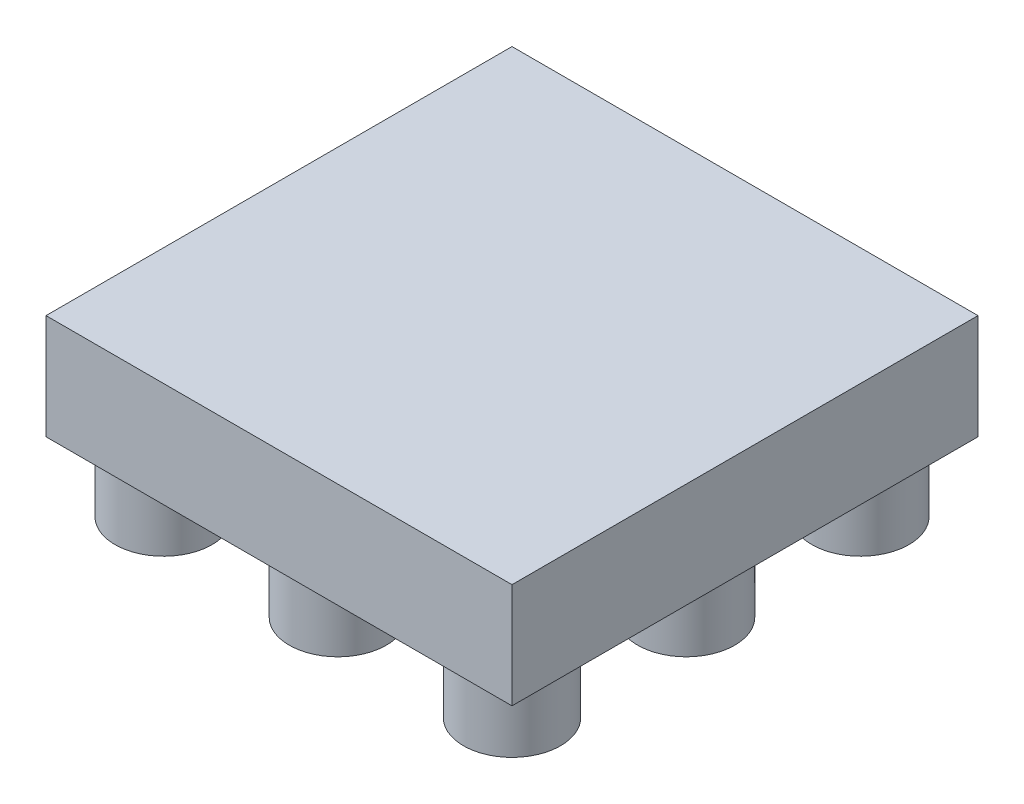
ISO-10303-21;
HEADER;
FILE_DESCRIPTION(('STEP AP214'),'2;1');
FILE_NAME('part.step','',(''),(''),'','','');
FILE_SCHEMA(('AUTOMOTIVE_DESIGN { 1 0 10303 214 1 1 1 1 }'));
ENDSEC;
DATA;
#1=APPLICATION_CONTEXT('core data for automotive mechanical design processes');
#2=APPLICATION_PROTOCOL_DEFINITION('international standard','automotive_design',2000,#1);
#3=PRODUCT_CONTEXT('',#1,'mechanical');
#4=PRODUCT('Part','Part','',(#3));
#5=PRODUCT_RELATED_PRODUCT_CATEGORY('part','',(#4));
#6=PRODUCT_DEFINITION_FORMATION('','',#4);
#7=PRODUCT_DEFINITION_CONTEXT('part definition',#1,'design');
#8=PRODUCT_DEFINITION('design','',#6,#7);
#9=PRODUCT_DEFINITION_SHAPE('','',#8);
#10=(LENGTH_UNIT() NAMED_UNIT(*) SI_UNIT(.MILLI.,.METRE.));
#11=(NAMED_UNIT(*) PLANE_ANGLE_UNIT() SI_UNIT($,.RADIAN.));
#12=(NAMED_UNIT(*) SI_UNIT($,.STERADIAN.) SOLID_ANGLE_UNIT());
#13=UNCERTAINTY_MEASURE_WITH_UNIT(LENGTH_MEASURE(1.E-05),#10,'distance_accuracy_value','');
#14=(GEOMETRIC_REPRESENTATION_CONTEXT(3) GLOBAL_UNCERTAINTY_ASSIGNED_CONTEXT((#13)) GLOBAL_UNIT_ASSIGNED_CONTEXT((#10,
#11,#12)) REPRESENTATION_CONTEXT('',''));
#15=CARTESIAN_POINT('',(0.,0.,0.));
#16=DIRECTION('',(0.,0.,1.));
#17=DIRECTION('',(1.,0.,0.));
#18=AXIS2_PLACEMENT_3D('',#15,#16,#17);
#19=CARTESIAN_POINT('',(7.01,1.5875,-26.31));
#20=DIRECTION('',(0.,-1.,0.));
#21=DIRECTION('',(0.,0.,-1.));
#22=AXIS2_PLACEMENT_3D('',#19,#20,#21);
#23=PLANE('',#22);
#24=CARTESIAN_POINT('',(12.3599999999999,1.5875,-16.96));
#25=DIRECTION('',(0.,-1.,0.));
#26=DIRECTION('',(0.,0.,-1.));
#27=AXIS2_PLACEMENT_3D('',#24,#25,#26);
#28=CIRCLE('',#27,1.115);
#29=CARTESIAN_POINT('',(12.3599999999999,1.5875,-18.075));
#30=VERTEX_POINT('',#29);
#31=EDGE_CURVE('E187',#30,#30,#28,.T.);
#32=ORIENTED_EDGE('',*,*,#31,.F.);
#33=EDGE_LOOP('',(#32));
#34=FACE_BOUND('',#33,.T.);
#35=CARTESIAN_POINT('',(8.35999999999996,1.5875,-20.9600000000001));
#36=DIRECTION('',(0.,-1.,0.));
#37=DIRECTION('',(0.,0.,-1.));
#38=AXIS2_PLACEMENT_3D('',#35,#36,#37);
#39=CIRCLE('',#38,1.115);
#40=CARTESIAN_POINT('',(8.35999999999996,1.5875,-22.0750000000001));
#41=VERTEX_POINT('',#40);
#42=EDGE_CURVE('E173',#41,#41,#39,.T.);
#43=ORIENTED_EDGE('',*,*,#42,.F.);
#44=EDGE_LOOP('',(#43));
#45=FACE_BOUND('',#44,.T.);
#46=CARTESIAN_POINT('',(16.36,1.5875,-20.96));
#47=DIRECTION('',(0.,-1.,0.));
#48=DIRECTION('',(0.,0.,-1.));
#49=AXIS2_PLACEMENT_3D('',#46,#47,#48);
#50=CIRCLE('',#49,1.115);
#51=CARTESIAN_POINT('',(16.36,1.5875,-22.075));
#52=VERTEX_POINT('',#51);
#53=EDGE_CURVE('E158',#52,#52,#50,.T.);
#54=ORIENTED_EDGE('',*,*,#53,.F.);
#55=EDGE_LOOP('',(#54));
#56=FACE_BOUND('',#55,.T.);
#57=CARTESIAN_POINT('',(12.36,1.5875,-24.96));
#58=DIRECTION('',(0.,-1.,0.));
#59=DIRECTION('',(0.,0.,-1.));
#60=AXIS2_PLACEMENT_3D('',#57,#58,#59);
#61=CIRCLE('',#60,1.115);
#62=CARTESIAN_POINT('',(12.36,1.5875,-26.075));
#63=VERTEX_POINT('',#62);
#64=EDGE_CURVE('E142',#63,#63,#61,.T.);
#65=ORIENTED_EDGE('',*,*,#64,.F.);
#66=EDGE_LOOP('',(#65));
#67=FACE_BOUND('',#66,.T.);
#68=DIRECTION('',(0.,0.,1.));
#69=VECTOR('',#68,1.);
#70=CARTESIAN_POINT('',(7.01,1.5875,-15.61));
#71=LINE('',#70,#69);
#72=CARTESIAN_POINT('',(7.01,1.5875,-26.31));
#73=VERTEX_POINT('',#72);
#74=CARTESIAN_POINT('',(7.01,1.5875,-15.61));
#75=VERTEX_POINT('',#74);
#76=EDGE_CURVE('E111',#73,#75,#71,.T.);
#77=ORIENTED_EDGE('',*,*,#76,.F.);
#78=DIRECTION('',(-1.,0.,0.));
#79=VECTOR('',#78,1.);
#80=CARTESIAN_POINT('',(7.01,1.5875,-26.31));
#81=LINE('',#80,#79);
#82=CARTESIAN_POINT('',(17.71,1.5875,-26.31));
#83=VERTEX_POINT('',#82);
#84=EDGE_CURVE('E81',#83,#73,#81,.T.);
#85=ORIENTED_EDGE('',*,*,#84,.F.);
#86=DIRECTION('',(0.,0.,-1.));
#87=VECTOR('',#86,1.);
#88=CARTESIAN_POINT('',(17.71,1.5875,-15.61));
#89=LINE('',#88,#87);
#90=CARTESIAN_POINT('',(17.71,1.5875,-15.61));
#91=VERTEX_POINT('',#90);
#92=EDGE_CURVE('E75',#91,#83,#89,.T.);
#93=ORIENTED_EDGE('',*,*,#92,.F.);
#94=DIRECTION('',(1.,0.,0.));
#95=VECTOR('',#94,1.);
#96=CARTESIAN_POINT('',(7.01,1.5875,-15.61));
#97=LINE('',#96,#95);
#98=EDGE_CURVE('E98',#75,#91,#97,.T.);
#99=ORIENTED_EDGE('',*,*,#98,.F.);
#100=EDGE_LOOP('',(#77,#85,#93,#99));
#101=FACE_BOUND('',#100,.T.);
#102=CARTESIAN_POINT('',(16.36,1.5875,-24.96));
#103=DIRECTION('',(0.,-1.,0.));
#104=DIRECTION('',(0.,0.,-1.));
#105=AXIS2_PLACEMENT_3D('',#102,#103,#104);
#106=CIRCLE('',#105,1.115);
#107=CARTESIAN_POINT('',(16.36,1.5875,-26.075));
#108=VERTEX_POINT('',#107);
#109=EDGE_CURVE('E134',#108,#108,#106,.T.);
#110=ORIENTED_EDGE('',*,*,#109,.F.);
#111=EDGE_LOOP('',(#110));
#112=FACE_BOUND('',#111,.T.);
#113=CARTESIAN_POINT('',(8.35999999999997,1.5875,-24.9600000000001));
#114=DIRECTION('',(0.,-1.,0.));
#115=DIRECTION('',(0.,0.,-1.));
#116=AXIS2_PLACEMENT_3D('',#113,#114,#115);
#117=CIRCLE('',#116,1.115);
#118=CARTESIAN_POINT('',(8.35999999999997,1.5875,-26.0750000000001));
#119=VERTEX_POINT('',#118);
#120=EDGE_CURVE('E150',#119,#119,#117,.T.);
#121=ORIENTED_EDGE('',*,*,#120,.F.);
#122=EDGE_LOOP('',(#121));
#123=FACE_BOUND('',#122,.T.);
#124=CARTESIAN_POINT('',(12.36,1.5875,-20.96));
#125=DIRECTION('',(0.,-1.,0.));
#126=DIRECTION('',(0.,0.,-1.));
#127=AXIS2_PLACEMENT_3D('',#124,#125,#126);
#128=CIRCLE('',#127,1.115);
#129=CARTESIAN_POINT('',(12.36,1.5875,-22.075));
#130=VERTEX_POINT('',#129);
#131=EDGE_CURVE('E166',#130,#130,#128,.T.);
#132=ORIENTED_EDGE('',*,*,#131,.F.);
#133=EDGE_LOOP('',(#132));
#134=FACE_BOUND('',#133,.T.);
#135=CARTESIAN_POINT('',(16.3599999999999,1.5875,-16.96));
#136=DIRECTION('',(0.,-1.,0.));
#137=DIRECTION('',(0.,0.,-1.));
#138=AXIS2_PLACEMENT_3D('',#135,#136,#137);
#139=CIRCLE('',#138,1.115);
#140=CARTESIAN_POINT('',(16.3599999999999,1.5875,-18.075));
#141=VERTEX_POINT('',#140);
#142=EDGE_CURVE('E179',#141,#141,#139,.T.);
#143=ORIENTED_EDGE('',*,*,#142,.F.);
#144=EDGE_LOOP('',(#143));
#145=FACE_BOUND('',#144,.T.);
#146=CARTESIAN_POINT('',(8.35999999999994,1.5875,-16.9600000000001));
#147=DIRECTION('',(0.,-1.,0.));
#148=DIRECTION('',(0.,0.,-1.));
#149=AXIS2_PLACEMENT_3D('',#146,#147,#148);
#150=CIRCLE('',#149,1.115);
#151=CARTESIAN_POINT('',(8.35999999999994,1.5875,-18.0750000000001));
#152=VERTEX_POINT('',#151);
#153=EDGE_CURVE('E194',#152,#152,#150,.T.);
#154=ORIENTED_EDGE('',*,*,#153,.F.);
#155=EDGE_LOOP('',(#154));
#156=FACE_BOUND('',#155,.T.);
#157=ADVANCED_FACE('F40',(#34,#45,#56,#67,#101,#112,#123,#134,#145,#156),#23,.T.);
#158=CARTESIAN_POINT('',(7.01,3.9975,-15.61));
#159=DIRECTION('',(1.,0.,0.));
#160=DIRECTION('',(0.,0.,-1.));
#161=AXIS2_PLACEMENT_3D('',#158,#159,#160);
#162=PLANE('',#161);
#163=ORIENTED_EDGE('',*,*,#76,.T.);
#164=DIRECTION('',(0.,-1.,0.));
#165=VECTOR('',#164,1.);
#166=CARTESIAN_POINT('',(7.01,3.9975,-15.61));
#167=LINE('',#166,#165);
#168=CARTESIAN_POINT('',(7.01,3.9975,-15.61));
#169=VERTEX_POINT('',#168);
#170=EDGE_CURVE('E11',#169,#75,#167,.T.);
#171=ORIENTED_EDGE('',*,*,#170,.F.);
#172=DIRECTION('',(0.,0.,1.));
#173=VECTOR('',#172,1.);
#174=CARTESIAN_POINT('',(7.01,3.9975,-15.61));
#175=LINE('',#174,#173);
#176=CARTESIAN_POINT('',(7.01,3.9975,-26.31));
#177=VERTEX_POINT('',#176);
#178=EDGE_CURVE('E93',#177,#169,#175,.T.);
#179=ORIENTED_EDGE('',*,*,#178,.F.);
#180=DIRECTION('',(0.,-1.,0.));
#181=VECTOR('',#180,1.);
#182=CARTESIAN_POINT('',(7.01,3.9975,-26.31));
#183=LINE('',#182,#181);
#184=EDGE_CURVE('E107',#177,#73,#183,.T.);
#185=ORIENTED_EDGE('',*,*,#184,.T.);
#186=EDGE_LOOP('',(#163,#171,#179,#185));
#187=FACE_BOUND('',#186,.T.);
#188=ADVANCED_FACE('F42',(#187),#162,.F.);
#189=CARTESIAN_POINT('',(7.01,3.9975,-15.61));
#190=DIRECTION('',(0.,0.,-1.));
#191=DIRECTION('',(-1.,0.,0.));
#192=AXIS2_PLACEMENT_3D('',#189,#190,#191);
#193=PLANE('',#192);
#194=ORIENTED_EDGE('',*,*,#98,.T.);
#195=DIRECTION('',(0.,-1.,0.));
#196=VECTOR('',#195,1.);
#197=CARTESIAN_POINT('',(17.71,3.9975,-15.61));
#198=LINE('',#197,#196);
#199=CARTESIAN_POINT('',(17.71,3.9975,-15.61));
#200=VERTEX_POINT('',#199);
#201=EDGE_CURVE('E50',#200,#91,#198,.T.);
#202=ORIENTED_EDGE('',*,*,#201,.F.);
#203=DIRECTION('',(1.,0.,0.));
#204=VECTOR('',#203,1.);
#205=CARTESIAN_POINT('',(7.01,3.9975,-15.61));
#206=LINE('',#205,#204);
#207=EDGE_CURVE('E88',#169,#200,#206,.T.);
#208=ORIENTED_EDGE('',*,*,#207,.F.);
#209=ORIENTED_EDGE('',*,*,#170,.T.);
#210=EDGE_LOOP('',(#194,#202,#208,#209));
#211=FACE_BOUND('',#210,.T.);
#212=ADVANCED_FACE('F97',(#211),#193,.F.);
#213=CARTESIAN_POINT('',(17.71,3.9975,-15.61));
#214=DIRECTION('',(-1.,0.,0.));
#215=DIRECTION('',(0.,0.,1.));
#216=AXIS2_PLACEMENT_3D('',#213,#214,#215);
#217=PLANE('',#216);
#218=ORIENTED_EDGE('',*,*,#92,.T.);
#219=DIRECTION('',(0.,-1.,0.));
#220=VECTOR('',#219,1.);
#221=CARTESIAN_POINT('',(17.71,3.9975,-26.31));
#222=LINE('',#221,#220);
#223=CARTESIAN_POINT('',(17.71,3.9975,-26.31));
#224=VERTEX_POINT('',#223);
#225=EDGE_CURVE('E100',#224,#83,#222,.T.);
#226=ORIENTED_EDGE('',*,*,#225,.F.);
#227=DIRECTION('',(0.,0.,-1.));
#228=VECTOR('',#227,1.);
#229=CARTESIAN_POINT('',(17.71,3.9975,-15.61));
#230=LINE('',#229,#228);
#231=EDGE_CURVE('E91',#200,#224,#230,.T.);
#232=ORIENTED_EDGE('',*,*,#231,.F.);
#233=ORIENTED_EDGE('',*,*,#201,.T.);
#234=EDGE_LOOP('',(#218,#226,#232,#233));
#235=FACE_BOUND('',#234,.T.);
#236=ADVANCED_FACE('F101',(#235),#217,.F.);
#237=CARTESIAN_POINT('',(7.01,3.9975,-26.31));
#238=DIRECTION('',(0.,0.,1.));
#239=DIRECTION('',(1.,0.,0.));
#240=AXIS2_PLACEMENT_3D('',#237,#238,#239);
#241=PLANE('',#240);
#242=ORIENTED_EDGE('',*,*,#84,.T.);
#243=ORIENTED_EDGE('',*,*,#184,.F.);
#244=DIRECTION('',(-1.,0.,0.));
#245=VECTOR('',#244,1.);
#246=CARTESIAN_POINT('',(7.01,3.9975,-26.31));
#247=LINE('',#246,#245);
#248=EDGE_CURVE('E58',#224,#177,#247,.T.);
#249=ORIENTED_EDGE('',*,*,#248,.F.);
#250=ORIENTED_EDGE('',*,*,#225,.T.);
#251=EDGE_LOOP('',(#242,#243,#249,#250));
#252=FACE_BOUND('',#251,.T.);
#253=ADVANCED_FACE('F126',(#252),#241,.F.);
#254=CARTESIAN_POINT('',(7.01,3.9975,-26.31));
#255=DIRECTION('',(0.,-1.,0.));
#256=DIRECTION('',(0.,0.,-1.));
#257=AXIS2_PLACEMENT_3D('',#254,#255,#256);
#258=PLANE('',#257);
#259=ORIENTED_EDGE('',*,*,#178,.T.);
#260=ORIENTED_EDGE('',*,*,#207,.T.);
#261=ORIENTED_EDGE('',*,*,#231,.T.);
#262=ORIENTED_EDGE('',*,*,#248,.T.);
#263=EDGE_LOOP('',(#259,#260,#261,#262));
#264=FACE_BOUND('',#263,.T.);
#265=ADVANCED_FACE('F89',(#264),#258,.F.);
#266=CARTESIAN_POINT('',(16.36,0.,-24.96));
#267=DIRECTION('',(0.,1.,0.));
#268=DIRECTION('',(0.,0.,1.));
#269=AXIS2_PLACEMENT_3D('',#266,#267,#268);
#270=CYLINDRICAL_SURFACE('',#269,1.115);
#271=CARTESIAN_POINT('',(16.36,0.,-24.96));
#272=DIRECTION('',(0.,-1.,0.));
#273=DIRECTION('',(0.,0.,-1.));
#274=AXIS2_PLACEMENT_3D('',#271,#272,#273);
#275=CIRCLE('',#274,1.115);
#276=CARTESIAN_POINT('',(16.36,0.,-26.075));
#277=VERTEX_POINT('',#276);
#278=EDGE_CURVE('E115',#277,#277,#275,.T.);
#279=ORIENTED_EDGE('',*,*,#278,.F.);
#280=EDGE_LOOP('',(#279));
#281=FACE_BOUND('',#280,.T.);
#282=ORIENTED_EDGE('',*,*,#109,.T.);
#283=EDGE_LOOP('',(#282));
#284=FACE_BOUND('',#283,.T.);
#285=ADVANCED_FACE('F241',(#281,#284),#270,.T.);
#286=CARTESIAN_POINT('',(16.36,0.,-24.96));
#287=DIRECTION('',(0.,-1.,0.));
#288=DIRECTION('',(0.,0.,-1.));
#289=AXIS2_PLACEMENT_3D('',#286,#287,#288);
#290=PLANE('',#289);
#291=ORIENTED_EDGE('',*,*,#278,.T.);
#292=EDGE_LOOP('',(#291));
#293=FACE_BOUND('',#292,.T.);
#294=ADVANCED_FACE('F246',(#293),#290,.T.);
#295=CARTESIAN_POINT('',(12.36,0.,-24.96));
#296=DIRECTION('',(0.,1.,0.));
#297=DIRECTION('',(0.,0.,1.));
#298=AXIS2_PLACEMENT_3D('',#295,#296,#297);
#299=CYLINDRICAL_SURFACE('',#298,1.115);
#300=CARTESIAN_POINT('',(12.36,0.,-24.96));
#301=DIRECTION('',(0.,-1.,0.));
#302=DIRECTION('',(0.,0.,-1.));
#303=AXIS2_PLACEMENT_3D('',#300,#301,#302);
#304=CIRCLE('',#303,1.115);
#305=CARTESIAN_POINT('',(12.36,0.,-26.075));
#306=VERTEX_POINT('',#305);
#307=EDGE_CURVE('E138',#306,#306,#304,.T.);
#308=ORIENTED_EDGE('',*,*,#307,.F.);
#309=EDGE_LOOP('',(#308));
#310=FACE_BOUND('',#309,.T.);
#311=ORIENTED_EDGE('',*,*,#64,.T.);
#312=EDGE_LOOP('',(#311));
#313=FACE_BOUND('',#312,.T.);
#314=ADVANCED_FACE('F252',(#310,#313),#299,.T.);
#315=CARTESIAN_POINT('',(12.36,0.,-24.96));
#316=DIRECTION('',(0.,-1.,0.));
#317=DIRECTION('',(0.,0.,-1.));
#318=AXIS2_PLACEMENT_3D('',#315,#316,#317);
#319=PLANE('',#318);
#320=ORIENTED_EDGE('',*,*,#307,.T.);
#321=EDGE_LOOP('',(#320));
#322=FACE_BOUND('',#321,.T.);
#323=ADVANCED_FACE('F259',(#322),#319,.T.);
#324=CARTESIAN_POINT('',(8.35999999999997,0.,-24.9600000000001));
#325=DIRECTION('',(0.,1.,0.));
#326=DIRECTION('',(0.,0.,1.));
#327=AXIS2_PLACEMENT_3D('',#324,#325,#326);
#328=CYLINDRICAL_SURFACE('',#327,1.115);
#329=CARTESIAN_POINT('',(8.35999999999997,0.,-24.9600000000001));
#330=DIRECTION('',(0.,-1.,0.));
#331=DIRECTION('',(0.,0.,-1.));
#332=AXIS2_PLACEMENT_3D('',#329,#330,#331);
#333=CIRCLE('',#332,1.115);
#334=CARTESIAN_POINT('',(8.35999999999997,0.,-26.0750000000001));
#335=VERTEX_POINT('',#334);
#336=EDGE_CURVE('E146',#335,#335,#333,.T.);
#337=ORIENTED_EDGE('',*,*,#336,.F.);
#338=EDGE_LOOP('',(#337));
#339=FACE_BOUND('',#338,.T.);
#340=ORIENTED_EDGE('',*,*,#120,.T.);
#341=EDGE_LOOP('',(#340));
#342=FACE_BOUND('',#341,.T.);
#343=ADVANCED_FACE('F266',(#339,#342),#328,.T.);
#344=CARTESIAN_POINT('',(8.35999999999997,0.,-24.9600000000001));
#345=DIRECTION('',(0.,-1.,0.));
#346=DIRECTION('',(0.,0.,-1.));
#347=AXIS2_PLACEMENT_3D('',#344,#345,#346);
#348=PLANE('',#347);
#349=ORIENTED_EDGE('',*,*,#336,.T.);
#350=EDGE_LOOP('',(#349));
#351=FACE_BOUND('',#350,.T.);
#352=ADVANCED_FACE('F273',(#351),#348,.T.);
#353=CARTESIAN_POINT('',(16.36,0.,-20.96));
#354=DIRECTION('',(0.,1.,0.));
#355=DIRECTION('',(0.,0.,1.));
#356=AXIS2_PLACEMENT_3D('',#353,#354,#355);
#357=CYLINDRICAL_SURFACE('',#356,1.115);
#358=CARTESIAN_POINT('',(16.36,0.,-20.96));
#359=DIRECTION('',(0.,-1.,0.));
#360=DIRECTION('',(0.,0.,-1.));
#361=AXIS2_PLACEMENT_3D('',#358,#359,#360);
#362=CIRCLE('',#361,1.115);
#363=CARTESIAN_POINT('',(16.36,0.,-22.075));
#364=VERTEX_POINT('',#363);
#365=EDGE_CURVE('E154',#364,#364,#362,.T.);
#366=ORIENTED_EDGE('',*,*,#365,.F.);
#367=EDGE_LOOP('',(#366));
#368=FACE_BOUND('',#367,.T.);
#369=ORIENTED_EDGE('',*,*,#53,.T.);
#370=EDGE_LOOP('',(#369));
#371=FACE_BOUND('',#370,.T.);
#372=ADVANCED_FACE('F280',(#368,#371),#357,.T.);
#373=CARTESIAN_POINT('',(16.36,0.,-20.96));
#374=DIRECTION('',(0.,-1.,0.));
#375=DIRECTION('',(0.,0.,-1.));
#376=AXIS2_PLACEMENT_3D('',#373,#374,#375);
#377=PLANE('',#376);
#378=ORIENTED_EDGE('',*,*,#365,.T.);
#379=EDGE_LOOP('',(#378));
#380=FACE_BOUND('',#379,.T.);
#381=ADVANCED_FACE('F287',(#380),#377,.T.);
#382=CARTESIAN_POINT('',(12.36,0.,-20.96));
#383=DIRECTION('',(0.,1.,0.));
#384=DIRECTION('',(0.,0.,1.));
#385=AXIS2_PLACEMENT_3D('',#382,#383,#384);
#386=CYLINDRICAL_SURFACE('',#385,1.115);
#387=CARTESIAN_POINT('',(12.36,0.,-20.96));
#388=DIRECTION('',(0.,-1.,0.));
#389=DIRECTION('',(0.,0.,-1.));
#390=AXIS2_PLACEMENT_3D('',#387,#388,#389);
#391=CIRCLE('',#390,1.115);
#392=CARTESIAN_POINT('',(12.36,0.,-22.075));
#393=VERTEX_POINT('',#392);
#394=EDGE_CURVE('E162',#393,#393,#391,.T.);
#395=ORIENTED_EDGE('',*,*,#394,.F.);
#396=EDGE_LOOP('',(#395));
#397=FACE_BOUND('',#396,.T.);
#398=ORIENTED_EDGE('',*,*,#131,.T.);
#399=EDGE_LOOP('',(#398));
#400=FACE_BOUND('',#399,.T.);
#401=ADVANCED_FACE('F294',(#397,#400),#386,.T.);
#402=CARTESIAN_POINT('',(12.36,0.,-20.96));
#403=DIRECTION('',(0.,-1.,0.));
#404=DIRECTION('',(0.,0.,-1.));
#405=AXIS2_PLACEMENT_3D('',#402,#403,#404);
#406=PLANE('',#405);
#407=ORIENTED_EDGE('',*,*,#394,.T.);
#408=EDGE_LOOP('',(#407));
#409=FACE_BOUND('',#408,.T.);
#410=ADVANCED_FACE('F301',(#409),#406,.T.);
#411=CARTESIAN_POINT('',(8.35999999999996,0.,-20.9600000000001));
#412=DIRECTION('',(0.,1.,0.));
#413=DIRECTION('',(0.,0.,1.));
#414=AXIS2_PLACEMENT_3D('',#411,#412,#413);
#415=CYLINDRICAL_SURFACE('',#414,1.115);
#416=CARTESIAN_POINT('',(8.35999999999996,0.,-20.9600000000001));
#417=DIRECTION('',(0.,-1.,0.));
#418=DIRECTION('',(0.,0.,-1.));
#419=AXIS2_PLACEMENT_3D('',#416,#417,#418);
#420=CIRCLE('',#419,1.115);
#421=CARTESIAN_POINT('',(8.35999999999996,0.,-22.0750000000001));
#422=VERTEX_POINT('',#421);
#423=EDGE_CURVE('E169',#422,#422,#420,.T.);
#424=ORIENTED_EDGE('',*,*,#423,.F.);
#425=EDGE_LOOP('',(#424));
#426=FACE_BOUND('',#425,.T.);
#427=ORIENTED_EDGE('',*,*,#42,.T.);
#428=EDGE_LOOP('',(#427));
#429=FACE_BOUND('',#428,.T.);
#430=ADVANCED_FACE('F308',(#426,#429),#415,.T.);
#431=CARTESIAN_POINT('',(8.35999999999996,0.,-20.9600000000001));
#432=DIRECTION('',(0.,-1.,0.));
#433=DIRECTION('',(0.,0.,-1.));
#434=AXIS2_PLACEMENT_3D('',#431,#432,#433);
#435=PLANE('',#434);
#436=ORIENTED_EDGE('',*,*,#423,.T.);
#437=EDGE_LOOP('',(#436));
#438=FACE_BOUND('',#437,.T.);
#439=ADVANCED_FACE('F315',(#438),#435,.T.);
#440=CARTESIAN_POINT('',(16.3599999999999,0.,-16.96));
#441=DIRECTION('',(0.,1.,0.));
#442=DIRECTION('',(0.,0.,1.));
#443=AXIS2_PLACEMENT_3D('',#440,#441,#442);
#444=CYLINDRICAL_SURFACE('',#443,1.115);
#445=CARTESIAN_POINT('',(16.3599999999999,0.,-16.96));
#446=DIRECTION('',(0.,-1.,0.));
#447=DIRECTION('',(0.,0.,-1.));
#448=AXIS2_PLACEMENT_3D('',#445,#446,#447);
#449=CIRCLE('',#448,1.115);
#450=CARTESIAN_POINT('',(16.3599999999999,0.,-18.075));
#451=VERTEX_POINT('',#450);
#452=EDGE_CURVE('E176',#451,#451,#449,.T.);
#453=ORIENTED_EDGE('',*,*,#452,.F.);
#454=EDGE_LOOP('',(#453));
#455=FACE_BOUND('',#454,.T.);
#456=ORIENTED_EDGE('',*,*,#142,.T.);
#457=EDGE_LOOP('',(#456));
#458=FACE_BOUND('',#457,.T.);
#459=ADVANCED_FACE('F322',(#455,#458),#444,.T.);
#460=CARTESIAN_POINT('',(16.3599999999999,0.,-16.96));
#461=DIRECTION('',(0.,-1.,0.));
#462=DIRECTION('',(0.,0.,-1.));
#463=AXIS2_PLACEMENT_3D('',#460,#461,#462);
#464=PLANE('',#463);
#465=ORIENTED_EDGE('',*,*,#452,.T.);
#466=EDGE_LOOP('',(#465));
#467=FACE_BOUND('',#466,.T.);
#468=ADVANCED_FACE('F329',(#467),#464,.T.);
#469=CARTESIAN_POINT('',(12.3599999999999,0.,-16.96));
#470=DIRECTION('',(0.,1.,0.));
#471=DIRECTION('',(0.,0.,1.));
#472=AXIS2_PLACEMENT_3D('',#469,#470,#471);
#473=CYLINDRICAL_SURFACE('',#472,1.115);
#474=CARTESIAN_POINT('',(12.3599999999999,0.,-16.96));
#475=DIRECTION('',(0.,-1.,0.));
#476=DIRECTION('',(0.,0.,-1.));
#477=AXIS2_PLACEMENT_3D('',#474,#475,#476);
#478=CIRCLE('',#477,1.115);
#479=CARTESIAN_POINT('',(12.3599999999999,0.,-18.075));
#480=VERTEX_POINT('',#479);
#481=EDGE_CURVE('E183',#480,#480,#478,.T.);
#482=ORIENTED_EDGE('',*,*,#481,.F.);
#483=EDGE_LOOP('',(#482));
#484=FACE_BOUND('',#483,.T.);
#485=ORIENTED_EDGE('',*,*,#31,.T.);
#486=EDGE_LOOP('',(#485));
#487=FACE_BOUND('',#486,.T.);
#488=ADVANCED_FACE('F336',(#484,#487),#473,.T.);
#489=CARTESIAN_POINT('',(12.3599999999999,0.,-16.96));
#490=DIRECTION('',(0.,-1.,0.));
#491=DIRECTION('',(0.,0.,-1.));
#492=AXIS2_PLACEMENT_3D('',#489,#490,#491);
#493=PLANE('',#492);
#494=ORIENTED_EDGE('',*,*,#481,.T.);
#495=EDGE_LOOP('',(#494));
#496=FACE_BOUND('',#495,.T.);
#497=ADVANCED_FACE('F207',(#496),#493,.T.);
#498=CARTESIAN_POINT('',(8.35999999999994,0.,-16.9600000000001));
#499=DIRECTION('',(0.,1.,0.));
#500=DIRECTION('',(0.,0.,1.));
#501=AXIS2_PLACEMENT_3D('',#498,#499,#500);
#502=CYLINDRICAL_SURFACE('',#501,1.115);
#503=CARTESIAN_POINT('',(8.35999999999994,0.,-16.9600000000001));
#504=DIRECTION('',(0.,-1.,0.));
#505=DIRECTION('',(0.,0.,-1.));
#506=AXIS2_PLACEMENT_3D('',#503,#504,#505);
#507=CIRCLE('',#506,1.115);
#508=CARTESIAN_POINT('',(8.35999999999994,0.,-18.0750000000001));
#509=VERTEX_POINT('',#508);
#510=EDGE_CURVE('E190',#509,#509,#507,.T.);
#511=ORIENTED_EDGE('',*,*,#510,.F.);
#512=EDGE_LOOP('',(#511));
#513=FACE_BOUND('',#512,.T.);
#514=ORIENTED_EDGE('',*,*,#153,.T.);
#515=EDGE_LOOP('',(#514));
#516=FACE_BOUND('',#515,.T.);
#517=ADVANCED_FACE('F204',(#513,#516),#502,.T.);
#518=CARTESIAN_POINT('',(8.35999999999994,0.,-16.9600000000001));
#519=DIRECTION('',(0.,-1.,0.));
#520=DIRECTION('',(0.,0.,-1.));
#521=AXIS2_PLACEMENT_3D('',#518,#519,#520);
#522=PLANE('',#521);
#523=ORIENTED_EDGE('',*,*,#510,.T.);
#524=EDGE_LOOP('',(#523));
#525=FACE_BOUND('',#524,.T.);
#526=ADVANCED_FACE('F202',(#525),#522,.T.);
#527=CLOSED_SHELL('',(#157,#188,#212,#236,#253,#265,#285,#294,#314,#323,#343,#352,#372,#381,
#401,#410,#430,#439,#459,#468,#488,#497,#517,#526));
#528=MANIFOLD_SOLID_BREP('B2',#527);
#529=ADVANCED_BREP_SHAPE_REPRESENTATION('',(#18,#528),#14);
#530=SHAPE_DEFINITION_REPRESENTATION(#9,#529);
ENDSEC;
END-ISO-10303-21;
